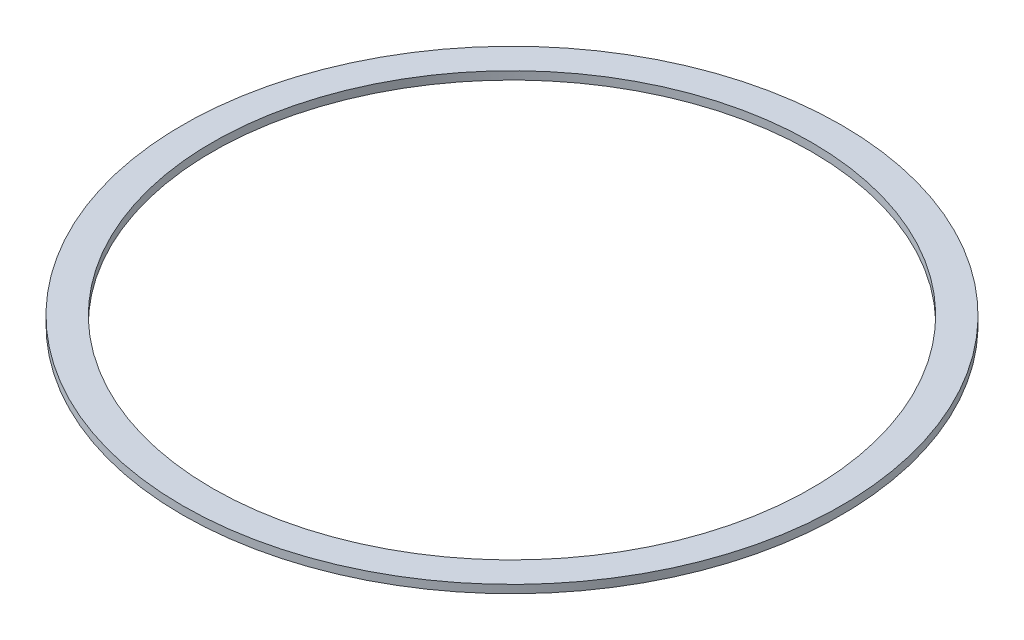
ISO-10303-21;
HEADER;
FILE_DESCRIPTION(('STEP AP214'),'2;1');
FILE_NAME('part.step','',(''),(''),'','','');
FILE_SCHEMA(('AUTOMOTIVE_DESIGN { 1 0 10303 214 1 1 1 1 }'));
ENDSEC;
DATA;
#1=APPLICATION_CONTEXT('core data for automotive mechanical design processes');
#2=APPLICATION_PROTOCOL_DEFINITION('international standard','automotive_design',2000,#1);
#3=PRODUCT_CONTEXT('',#1,'mechanical');
#4=PRODUCT('Part','Part','',(#3));
#5=PRODUCT_RELATED_PRODUCT_CATEGORY('part','',(#4));
#6=PRODUCT_DEFINITION_FORMATION('','',#4);
#7=PRODUCT_DEFINITION_CONTEXT('part definition',#1,'design');
#8=PRODUCT_DEFINITION('design','',#6,#7);
#9=PRODUCT_DEFINITION_SHAPE('','',#8);
#10=(LENGTH_UNIT() NAMED_UNIT(*) SI_UNIT(.MILLI.,.METRE.));
#11=(NAMED_UNIT(*) PLANE_ANGLE_UNIT() SI_UNIT($,.RADIAN.));
#12=(NAMED_UNIT(*) SI_UNIT($,.STERADIAN.) SOLID_ANGLE_UNIT());
#13=UNCERTAINTY_MEASURE_WITH_UNIT(LENGTH_MEASURE(1.E-05),#10,'distance_accuracy_value','');
#14=(GEOMETRIC_REPRESENTATION_CONTEXT(3) GLOBAL_UNCERTAINTY_ASSIGNED_CONTEXT((#13)) GLOBAL_UNIT_ASSIGNED_CONTEXT((#10,
#11,#12)) REPRESENTATION_CONTEXT('',''));
#15=CARTESIAN_POINT('',(0.,0.,0.));
#16=DIRECTION('',(0.,0.,1.));
#17=DIRECTION('',(1.,0.,0.));
#18=AXIS2_PLACEMENT_3D('',#15,#16,#17);
#19=CARTESIAN_POINT('',(0.,2.4,0.));
#20=DIRECTION('',(0.,1.,0.));
#21=DIRECTION('',(0.,0.,1.));
#22=AXIS2_PLACEMENT_3D('',#19,#20,#21);
#23=PLANE('',#22);
#24=CARTESIAN_POINT('',(0.,2.4,0.));
#25=DIRECTION('',(0.,1.,0.));
#26=DIRECTION('',(0.,0.,1.));
#27=AXIS2_PLACEMENT_3D('',#24,#25,#26);
#28=CIRCLE('',#27,97.79);
#29=CARTESIAN_POINT('',(0.,2.4,97.79));
#30=VERTEX_POINT('',#29);
#31=EDGE_CURVE('E10',#30,#30,#28,.T.);
#32=ORIENTED_EDGE('',*,*,#31,.T.);
#33=EDGE_LOOP('',(#32));
#34=FACE_BOUND('',#33,.T.);
#35=CARTESIAN_POINT('',(0.,2.4,0.));
#36=DIRECTION('',(0.,1.,0.));
#37=DIRECTION('',(0.,0.,1.));
#38=AXIS2_PLACEMENT_3D('',#35,#36,#37);
#39=CIRCLE('',#38,88.9);
#40=CARTESIAN_POINT('',(0.,2.4,88.9));
#41=VERTEX_POINT('',#40);
#42=EDGE_CURVE('E43',#41,#41,#39,.T.);
#43=ORIENTED_EDGE('',*,*,#42,.F.);
#44=EDGE_LOOP('',(#43));
#45=FACE_BOUND('',#44,.T.);
#46=ADVANCED_FACE('F32',(#34,#45),#23,.T.);
#47=CARTESIAN_POINT('',(0.,0.,0.));
#48=DIRECTION('',(0.,1.,0.));
#49=DIRECTION('',(0.,0.,1.));
#50=AXIS2_PLACEMENT_3D('',#47,#48,#49);
#51=PLANE('',#50);
#52=CARTESIAN_POINT('',(0.,0.,0.));
#53=DIRECTION('',(0.,1.,0.));
#54=DIRECTION('',(0.,0.,1.));
#55=AXIS2_PLACEMENT_3D('',#52,#53,#54);
#56=CIRCLE('',#55,97.79);
#57=CARTESIAN_POINT('',(0.,0.,97.79));
#58=VERTEX_POINT('',#57);
#59=EDGE_CURVE('E36',#58,#58,#56,.T.);
#60=ORIENTED_EDGE('',*,*,#59,.F.);
#61=EDGE_LOOP('',(#60));
#62=FACE_BOUND('',#61,.T.);
#63=CARTESIAN_POINT('',(0.,0.,0.));
#64=DIRECTION('',(0.,1.,0.));
#65=DIRECTION('',(0.,0.,1.));
#66=AXIS2_PLACEMENT_3D('',#63,#64,#65);
#67=CIRCLE('',#66,88.9);
#68=CARTESIAN_POINT('',(0.,0.,88.9));
#69=VERTEX_POINT('',#68);
#70=EDGE_CURVE('E45',#69,#69,#67,.T.);
#71=ORIENTED_EDGE('',*,*,#70,.T.);
#72=EDGE_LOOP('',(#71));
#73=FACE_BOUND('',#72,.T.);
#74=ADVANCED_FACE('F55',(#62,#73),#51,.F.);
#75=CARTESIAN_POINT('',(0.,2.4,0.));
#76=DIRECTION('',(0.,-1.,0.));
#77=DIRECTION('',(0.,0.,-1.));
#78=AXIS2_PLACEMENT_3D('',#75,#76,#77);
#79=CYLINDRICAL_SURFACE('',#78,97.79);
#80=ORIENTED_EDGE('',*,*,#31,.F.);
#81=EDGE_LOOP('',(#80));
#82=FACE_BOUND('',#81,.T.);
#83=ORIENTED_EDGE('',*,*,#59,.T.);
#84=EDGE_LOOP('',(#83));
#85=FACE_BOUND('',#84,.T.);
#86=ADVANCED_FACE('F34',(#82,#85),#79,.T.);
#87=CARTESIAN_POINT('',(0.,2.4,0.));
#88=DIRECTION('',(0.,-1.,0.));
#89=DIRECTION('',(0.,0.,-1.));
#90=AXIS2_PLACEMENT_3D('',#87,#88,#89);
#91=CYLINDRICAL_SURFACE('',#90,88.9);
#92=ORIENTED_EDGE('',*,*,#42,.T.);
#93=EDGE_LOOP('',(#92));
#94=FACE_BOUND('',#93,.T.);
#95=ORIENTED_EDGE('',*,*,#70,.F.);
#96=EDGE_LOOP('',(#95));
#97=FACE_BOUND('',#96,.T.);
#98=ADVANCED_FACE('F51',(#94,#97),#91,.F.);
#99=CLOSED_SHELL('',(#46,#74,#86,#98));
#100=MANIFOLD_SOLID_BREP('B2',#99);
#101=ADVANCED_BREP_SHAPE_REPRESENTATION('',(#18,#100),#14);
#102=SHAPE_DEFINITION_REPRESENTATION(#9,#101);
ENDSEC;
END-ISO-10303-21;
